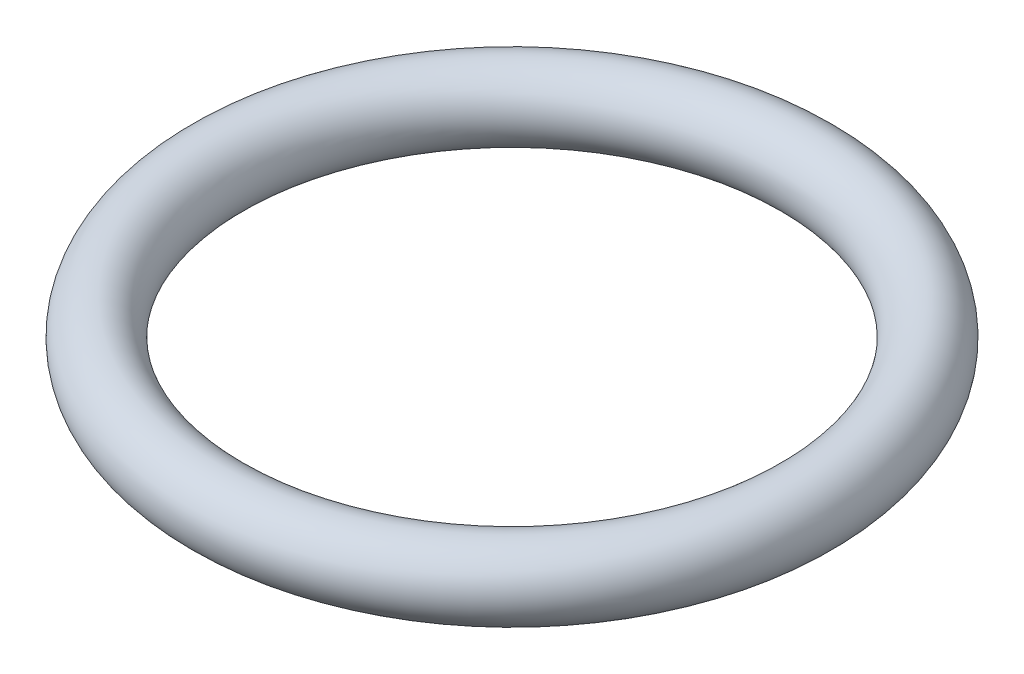
ISO-10303-21;
HEADER;
FILE_DESCRIPTION(('STEP AP214'),'2;1');
FILE_NAME('part.step','',(''),(''),'','','');
FILE_SCHEMA(('AUTOMOTIVE_DESIGN { 1 0 10303 214 1 1 1 1 }'));
ENDSEC;
DATA;
#1=APPLICATION_CONTEXT('core data for automotive mechanical design processes');
#2=APPLICATION_PROTOCOL_DEFINITION('international standard','automotive_design',2000,#1);
#3=PRODUCT_CONTEXT('',#1,'mechanical');
#4=PRODUCT('Part','Part','',(#3));
#5=PRODUCT_RELATED_PRODUCT_CATEGORY('part','',(#4));
#6=PRODUCT_DEFINITION_FORMATION('','',#4);
#7=PRODUCT_DEFINITION_CONTEXT('part definition',#1,'design');
#8=PRODUCT_DEFINITION('design','',#6,#7);
#9=PRODUCT_DEFINITION_SHAPE('','',#8);
#10=(LENGTH_UNIT() NAMED_UNIT(*) SI_UNIT(.MILLI.,.METRE.));
#11=(NAMED_UNIT(*) PLANE_ANGLE_UNIT() SI_UNIT($,.RADIAN.));
#12=(NAMED_UNIT(*) SI_UNIT($,.STERADIAN.) SOLID_ANGLE_UNIT());
#13=UNCERTAINTY_MEASURE_WITH_UNIT(LENGTH_MEASURE(1.E-05),#10,'distance_accuracy_value','');
#14=(GEOMETRIC_REPRESENTATION_CONTEXT(3) GLOBAL_UNCERTAINTY_ASSIGNED_CONTEXT((#13)) GLOBAL_UNIT_ASSIGNED_CONTEXT((#10,
#11,#12)) REPRESENTATION_CONTEXT('',''));
#15=CARTESIAN_POINT('',(0.,0.,0.));
#16=DIRECTION('',(0.,0.,1.));
#17=DIRECTION('',(1.,0.,0.));
#18=AXIS2_PLACEMENT_3D('',#15,#16,#17);
#19=CARTESIAN_POINT('',(0.,0.,0.));
#20=DIRECTION('',(0.,1.,0.));
#21=DIRECTION('',(0.,0.,1.));
#22=AXIS2_PLACEMENT_3D('',#19,#20,#21);
#23=TOROIDAL_SURFACE('',#22,8.25,1.);
#24=CARTESIAN_POINT('',(0.,0.,9.25));
#25=VERTEX_POINT('',#24);
#26=VERTEX_LOOP('',#25);
#27=FACE_BOUND('',#26,.T.);
#28=ADVANCED_FACE('F30',(#27),#23,.T.);
#29=CLOSED_SHELL('',(#28));
#30=MANIFOLD_SOLID_BREP('B2',#29);
#31=ADVANCED_BREP_SHAPE_REPRESENTATION('',(#18,#30),#14);
#32=SHAPE_DEFINITION_REPRESENTATION(#9,#31);
ENDSEC;
END-ISO-10303-21;
